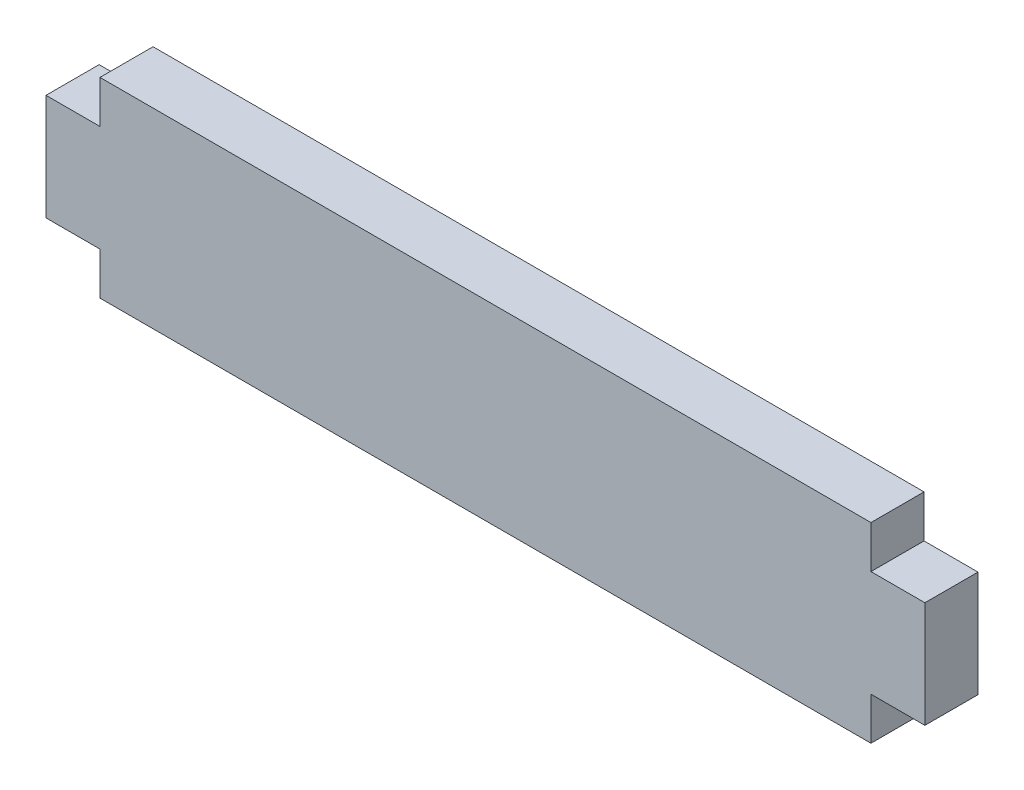
ISO-10303-21;
HEADER;
FILE_DESCRIPTION(('STEP AP214'),'2;1');
FILE_NAME('part.step','',(''),(''),'','','');
FILE_SCHEMA(('AUTOMOTIVE_DESIGN { 1 0 10303 214 1 1 1 1 }'));
ENDSEC;
DATA;
#1=APPLICATION_CONTEXT('core data for automotive mechanical design processes');
#2=APPLICATION_PROTOCOL_DEFINITION('international standard','automotive_design',2000,#1);
#3=PRODUCT_CONTEXT('',#1,'mechanical');
#4=PRODUCT('Part','Part','',(#3));
#5=PRODUCT_RELATED_PRODUCT_CATEGORY('part','',(#4));
#6=PRODUCT_DEFINITION_FORMATION('','',#4);
#7=PRODUCT_DEFINITION_CONTEXT('part definition',#1,'design');
#8=PRODUCT_DEFINITION('design','',#6,#7);
#9=PRODUCT_DEFINITION_SHAPE('','',#8);
#10=(LENGTH_UNIT() NAMED_UNIT(*) SI_UNIT(.MILLI.,.METRE.));
#11=(NAMED_UNIT(*) PLANE_ANGLE_UNIT() SI_UNIT($,.RADIAN.));
#12=(NAMED_UNIT(*) SI_UNIT($,.STERADIAN.) SOLID_ANGLE_UNIT());
#13=UNCERTAINTY_MEASURE_WITH_UNIT(LENGTH_MEASURE(1.E-05),#10,'distance_accuracy_value','');
#14=(GEOMETRIC_REPRESENTATION_CONTEXT(3) GLOBAL_UNCERTAINTY_ASSIGNED_CONTEXT((#13)) GLOBAL_UNIT_ASSIGNED_CONTEXT((#10,
#11,#12)) REPRESENTATION_CONTEXT('',''));
#15=CARTESIAN_POINT('',(0.,0.,0.));
#16=DIRECTION('',(0.,0.,1.));
#17=DIRECTION('',(1.,0.,0.));
#18=AXIS2_PLACEMENT_3D('',#15,#16,#17);
#19=CARTESIAN_POINT('',(23.0505,3.175,3.175));
#20=DIRECTION('',(-1.,0.,0.));
#21=DIRECTION('',(0.,0.,1.));
#22=AXIS2_PLACEMENT_3D('',#19,#20,#21);
#23=PLANE('',#22);
#24=DIRECTION('',(0.,1.,0.));
#25=VECTOR('',#24,1.);
#26=CARTESIAN_POINT('',(23.0505,3.175,0.));
#27=LINE('',#26,#25);
#28=CARTESIAN_POINT('',(23.0505,3.175,0.));
#29=VERTEX_POINT('',#28);
#30=CARTESIAN_POINT('',(23.0505,5.715,0.));
#31=VERTEX_POINT('',#30);
#32=EDGE_CURVE('E152',#29,#31,#27,.T.);
#33=ORIENTED_EDGE('',*,*,#32,.T.);
#34=DIRECTION('',(0.,0.,-1.));
#35=VECTOR('',#34,1.);
#36=CARTESIAN_POINT('',(23.0505,5.715,3.175));
#37=LINE('',#36,#35);
#38=CARTESIAN_POINT('',(23.0505,5.715,3.175));
#39=VERTEX_POINT('',#38);
#40=EDGE_CURVE('E11',#39,#31,#37,.T.);
#41=ORIENTED_EDGE('',*,*,#40,.F.);
#42=DIRECTION('',(0.,1.,0.));
#43=VECTOR('',#42,1.);
#44=CARTESIAN_POINT('',(23.0505,3.175,3.175));
#45=LINE('',#44,#43);
#46=CARTESIAN_POINT('',(23.0505,3.175,3.175));
#47=VERTEX_POINT('',#46);
#48=EDGE_CURVE('E174',#47,#39,#45,.T.);
#49=ORIENTED_EDGE('',*,*,#48,.F.);
#50=DIRECTION('',(0.,0.,-1.));
#51=VECTOR('',#50,1.);
#52=CARTESIAN_POINT('',(23.0505,3.175,3.175));
#53=LINE('',#52,#51);
#54=EDGE_CURVE('E148',#47,#29,#53,.T.);
#55=ORIENTED_EDGE('',*,*,#54,.T.);
#56=EDGE_LOOP('',(#33,#41,#49,#55));
#57=FACE_BOUND('',#56,.T.);
#58=ADVANCED_FACE('F32',(#57),#23,.F.);
#59=CARTESIAN_POINT('',(-23.0505,5.715,3.175));
#60=DIRECTION('',(0.,-1.,0.));
#61=DIRECTION('',(0.,0.,-1.));
#62=AXIS2_PLACEMENT_3D('',#59,#60,#61);
#63=PLANE('',#62);
#64=DIRECTION('',(-1.,0.,0.));
#65=VECTOR('',#64,1.);
#66=CARTESIAN_POINT('',(-23.0505,5.715,0.));
#67=LINE('',#66,#65);
#68=CARTESIAN_POINT('',(-23.0505,5.715,0.));
#69=VERTEX_POINT('',#68);
#70=EDGE_CURVE('E155',#31,#69,#67,.T.);
#71=ORIENTED_EDGE('',*,*,#70,.T.);
#72=DIRECTION('',(0.,0.,-1.));
#73=VECTOR('',#72,1.);
#74=CARTESIAN_POINT('',(-23.0505,5.715,3.175));
#75=LINE('',#74,#73);
#76=CARTESIAN_POINT('',(-23.0505,5.715,3.175));
#77=VERTEX_POINT('',#76);
#78=EDGE_CURVE('E40',#77,#69,#75,.T.);
#79=ORIENTED_EDGE('',*,*,#78,.F.);
#80=DIRECTION('',(-1.,0.,0.));
#81=VECTOR('',#80,1.);
#82=CARTESIAN_POINT('',(-23.0505,5.715,3.175));
#83=LINE('',#82,#81);
#84=EDGE_CURVE('E103',#39,#77,#83,.T.);
#85=ORIENTED_EDGE('',*,*,#84,.F.);
#86=ORIENTED_EDGE('',*,*,#40,.T.);
#87=EDGE_LOOP('',(#71,#79,#85,#86));
#88=FACE_BOUND('',#87,.T.);
#89=ADVANCED_FACE('F252',(#88),#63,.F.);
#90=CARTESIAN_POINT('',(-23.0505,3.175,3.175));
#91=DIRECTION('',(1.,0.,0.));
#92=DIRECTION('',(0.,0.,-1.));
#93=AXIS2_PLACEMENT_3D('',#90,#91,#92);
#94=PLANE('',#93);
#95=DIRECTION('',(0.,-1.,0.));
#96=VECTOR('',#95,1.);
#97=CARTESIAN_POINT('',(-23.0505,3.175,0.));
#98=LINE('',#97,#96);
#99=CARTESIAN_POINT('',(-23.0505,3.175,0.));
#100=VERTEX_POINT('',#99);
#101=EDGE_CURVE('E157',#69,#100,#98,.T.);
#102=ORIENTED_EDGE('',*,*,#101,.T.);
#103=DIRECTION('',(0.,0.,-1.));
#104=VECTOR('',#103,1.);
#105=CARTESIAN_POINT('',(-23.0505,3.175,3.175));
#106=LINE('',#105,#104);
#107=CARTESIAN_POINT('',(-23.0505,3.175,3.175));
#108=VERTEX_POINT('',#107);
#109=EDGE_CURVE('E193',#108,#100,#106,.T.);
#110=ORIENTED_EDGE('',*,*,#109,.F.);
#111=DIRECTION('',(0.,-1.,0.));
#112=VECTOR('',#111,1.);
#113=CARTESIAN_POINT('',(-23.0505,3.175,3.175));
#114=LINE('',#113,#112);
#115=EDGE_CURVE('E201',#77,#108,#114,.T.);
#116=ORIENTED_EDGE('',*,*,#115,.F.);
#117=ORIENTED_EDGE('',*,*,#78,.T.);
#118=EDGE_LOOP('',(#102,#110,#116,#117));
#119=FACE_BOUND('',#118,.T.);
#120=ADVANCED_FACE('F199',(#119),#94,.F.);
#121=CARTESIAN_POINT('',(-23.0505,3.175,3.175));
#122=DIRECTION('',(0.,-1.,0.));
#123=DIRECTION('',(1.,0.,0.));
#124=AXIS2_PLACEMENT_3D('',#121,#122,#123);
#125=PLANE('',#124);
#126=DIRECTION('',(-1.,0.,0.));
#127=VECTOR('',#126,1.);
#128=CARTESIAN_POINT('',(-23.0505,3.175,0.));
#129=LINE('',#128,#127);
#130=CARTESIAN_POINT('',(-26.2763,3.175,0.));
#131=VERTEX_POINT('',#130);
#132=EDGE_CURVE('E159',#100,#131,#129,.T.);
#133=ORIENTED_EDGE('',*,*,#132,.T.);
#134=DIRECTION('',(0.,0.,-1.));
#135=VECTOR('',#134,1.);
#136=CARTESIAN_POINT('',(-26.2763,3.175,3.175));
#137=LINE('',#136,#135);
#138=CARTESIAN_POINT('',(-26.2763,3.175,3.175));
#139=VERTEX_POINT('',#138);
#140=EDGE_CURVE('E190',#139,#131,#137,.T.);
#141=ORIENTED_EDGE('',*,*,#140,.F.);
#142=DIRECTION('',(-1.,0.,0.));
#143=VECTOR('',#142,1.);
#144=CARTESIAN_POINT('',(-23.0505,3.175,3.175));
#145=LINE('',#144,#143);
#146=EDGE_CURVE('E219',#108,#139,#145,.T.);
#147=ORIENTED_EDGE('',*,*,#146,.F.);
#148=ORIENTED_EDGE('',*,*,#109,.T.);
#149=EDGE_LOOP('',(#133,#141,#147,#148));
#150=FACE_BOUND('',#149,.T.);
#151=ADVANCED_FACE('F210',(#150),#125,.F.);
#152=CARTESIAN_POINT('',(-26.2763,3.175,3.175));
#153=DIRECTION('',(1.,0.,0.));
#154=DIRECTION('',(0.,0.,-1.));
#155=AXIS2_PLACEMENT_3D('',#152,#153,#154);
#156=PLANE('',#155);
#157=DIRECTION('',(0.,-1.,0.));
#158=VECTOR('',#157,1.);
#159=CARTESIAN_POINT('',(-26.2763,3.175,0.));
#160=LINE('',#159,#158);
#161=CARTESIAN_POINT('',(-26.2763,-3.175,0.));
#162=VERTEX_POINT('',#161);
#163=EDGE_CURVE('E161',#131,#162,#160,.T.);
#164=ORIENTED_EDGE('',*,*,#163,.T.);
#165=DIRECTION('',(0.,0.,-1.));
#166=VECTOR('',#165,1.);
#167=CARTESIAN_POINT('',(-26.2763,-3.175,3.175));
#168=LINE('',#167,#166);
#169=CARTESIAN_POINT('',(-26.2763,-3.175,3.175));
#170=VERTEX_POINT('',#169);
#171=EDGE_CURVE('E187',#170,#162,#168,.T.);
#172=ORIENTED_EDGE('',*,*,#171,.F.);
#173=DIRECTION('',(0.,-1.,0.));
#174=VECTOR('',#173,1.);
#175=CARTESIAN_POINT('',(-26.2763,3.175,3.175));
#176=LINE('',#175,#174);
#177=EDGE_CURVE('E216',#139,#170,#176,.T.);
#178=ORIENTED_EDGE('',*,*,#177,.F.);
#179=ORIENTED_EDGE('',*,*,#140,.T.);
#180=EDGE_LOOP('',(#164,#172,#178,#179));
#181=FACE_BOUND('',#180,.T.);
#182=ADVANCED_FACE('F214',(#181),#156,.F.);
#183=CARTESIAN_POINT('',(-26.2763,-3.175,3.175));
#184=DIRECTION('',(0.,1.,0.));
#185=DIRECTION('',(0.,0.,1.));
#186=AXIS2_PLACEMENT_3D('',#183,#184,#185);
#187=PLANE('',#186);
#188=DIRECTION('',(1.,0.,0.));
#189=VECTOR('',#188,1.);
#190=CARTESIAN_POINT('',(-26.2763,-3.175,0.));
#191=LINE('',#190,#189);
#192=CARTESIAN_POINT('',(-23.0505,-3.175,0.));
#193=VERTEX_POINT('',#192);
#194=EDGE_CURVE('E163',#162,#193,#191,.T.);
#195=ORIENTED_EDGE('',*,*,#194,.T.);
#196=DIRECTION('',(0.,0.,-1.));
#197=VECTOR('',#196,1.);
#198=CARTESIAN_POINT('',(-23.0505,-3.175,3.175));
#199=LINE('',#198,#197);
#200=CARTESIAN_POINT('',(-23.0505,-3.175,3.175));
#201=VERTEX_POINT('',#200);
#202=EDGE_CURVE('E184',#201,#193,#199,.T.);
#203=ORIENTED_EDGE('',*,*,#202,.F.);
#204=DIRECTION('',(1.,0.,0.));
#205=VECTOR('',#204,1.);
#206=CARTESIAN_POINT('',(-26.2763,-3.175,3.175));
#207=LINE('',#206,#205);
#208=EDGE_CURVE('E218',#170,#201,#207,.T.);
#209=ORIENTED_EDGE('',*,*,#208,.F.);
#210=ORIENTED_EDGE('',*,*,#171,.T.);
#211=EDGE_LOOP('',(#195,#203,#209,#210));
#212=FACE_BOUND('',#211,.T.);
#213=ADVANCED_FACE('F265',(#212),#187,.F.);
#214=CARTESIAN_POINT('',(-23.0505,-5.715,3.175));
#215=DIRECTION('',(1.,0.,0.));
#216=DIRECTION('',(0.,0.,-1.));
#217=AXIS2_PLACEMENT_3D('',#214,#215,#216);
#218=PLANE('',#217);
#219=DIRECTION('',(0.,-1.,0.));
#220=VECTOR('',#219,1.);
#221=CARTESIAN_POINT('',(-23.0505,-5.715,0.));
#222=LINE('',#221,#220);
#223=CARTESIAN_POINT('',(-23.0505,-5.715,0.));
#224=VERTEX_POINT('',#223);
#225=EDGE_CURVE('E165',#193,#224,#222,.T.);
#226=ORIENTED_EDGE('',*,*,#225,.T.);
#227=DIRECTION('',(0.,0.,-1.));
#228=VECTOR('',#227,1.);
#229=CARTESIAN_POINT('',(-23.0505,-5.715,3.175));
#230=LINE('',#229,#228);
#231=CARTESIAN_POINT('',(-23.0505,-5.715,3.175));
#232=VERTEX_POINT('',#231);
#233=EDGE_CURVE('E181',#232,#224,#230,.T.);
#234=ORIENTED_EDGE('',*,*,#233,.F.);
#235=DIRECTION('',(0.,-1.,0.));
#236=VECTOR('',#235,1.);
#237=CARTESIAN_POINT('',(-23.0505,-5.715,3.175));
#238=LINE('',#237,#236);
#239=EDGE_CURVE('E221',#201,#232,#238,.T.);
#240=ORIENTED_EDGE('',*,*,#239,.F.);
#241=ORIENTED_EDGE('',*,*,#202,.T.);
#242=EDGE_LOOP('',(#226,#234,#240,#241));
#243=FACE_BOUND('',#242,.T.);
#244=ADVANCED_FACE('F268',(#243),#218,.F.);
#245=CARTESIAN_POINT('',(-23.0505,-5.715,3.175));
#246=DIRECTION('',(0.,1.,0.));
#247=DIRECTION('',(0.,0.,1.));
#248=AXIS2_PLACEMENT_3D('',#245,#246,#247);
#249=PLANE('',#248);
#250=DIRECTION('',(1.,0.,0.));
#251=VECTOR('',#250,1.);
#252=CARTESIAN_POINT('',(-23.0505,-5.715,0.));
#253=LINE('',#252,#251);
#254=CARTESIAN_POINT('',(23.0505,-5.715,0.));
#255=VERTEX_POINT('',#254);
#256=EDGE_CURVE('E167',#224,#255,#253,.T.);
#257=ORIENTED_EDGE('',*,*,#256,.T.);
#258=DIRECTION('',(0.,0.,-1.));
#259=VECTOR('',#258,1.);
#260=CARTESIAN_POINT('',(23.0505,-5.715,3.175));
#261=LINE('',#260,#259);
#262=CARTESIAN_POINT('',(23.0505,-5.715,3.175));
#263=VERTEX_POINT('',#262);
#264=EDGE_CURVE('E178',#263,#255,#261,.T.);
#265=ORIENTED_EDGE('',*,*,#264,.F.);
#266=DIRECTION('',(1.,0.,0.));
#267=VECTOR('',#266,1.);
#268=CARTESIAN_POINT('',(-23.0505,-5.715,3.175));
#269=LINE('',#268,#267);
#270=EDGE_CURVE('E227',#232,#263,#269,.T.);
#271=ORIENTED_EDGE('',*,*,#270,.F.);
#272=ORIENTED_EDGE('',*,*,#233,.T.);
#273=EDGE_LOOP('',(#257,#265,#271,#272));
#274=FACE_BOUND('',#273,.T.);
#275=ADVANCED_FACE('F233',(#274),#249,.F.);
#276=CARTESIAN_POINT('',(23.0505,-5.715,3.175));
#277=DIRECTION('',(-1.,0.,0.));
#278=DIRECTION('',(0.,0.,1.));
#279=AXIS2_PLACEMENT_3D('',#276,#277,#278);
#280=PLANE('',#279);
#281=DIRECTION('',(0.,1.,0.));
#282=VECTOR('',#281,1.);
#283=CARTESIAN_POINT('',(23.0505,-5.715,0.));
#284=LINE('',#283,#282);
#285=CARTESIAN_POINT('',(23.0505,-3.17500000000001,0.));
#286=VERTEX_POINT('',#285);
#287=EDGE_CURVE('E169',#255,#286,#284,.T.);
#288=ORIENTED_EDGE('',*,*,#287,.T.);
#289=DIRECTION('',(0.,0.,-1.));
#290=VECTOR('',#289,1.);
#291=CARTESIAN_POINT('',(23.0505,-3.17500000000001,3.175));
#292=LINE('',#291,#290);
#293=CARTESIAN_POINT('',(23.0505,-3.17500000000001,3.175));
#294=VERTEX_POINT('',#293);
#295=EDGE_CURVE('E143',#294,#286,#292,.T.);
#296=ORIENTED_EDGE('',*,*,#295,.F.);
#297=DIRECTION('',(0.,1.,0.));
#298=VECTOR('',#297,1.);
#299=CARTESIAN_POINT('',(23.0505,-5.715,3.175));
#300=LINE('',#299,#298);
#301=EDGE_CURVE('E134',#263,#294,#300,.T.);
#302=ORIENTED_EDGE('',*,*,#301,.F.);
#303=ORIENTED_EDGE('',*,*,#264,.T.);
#304=EDGE_LOOP('',(#288,#296,#302,#303));
#305=FACE_BOUND('',#304,.T.);
#306=ADVANCED_FACE('F237',(#305),#280,.F.);
#307=CARTESIAN_POINT('',(26.2763,-3.17500000000001,3.175));
#308=DIRECTION('',(0.,1.,0.));
#309=DIRECTION('',(-1.,0.,0.));
#310=AXIS2_PLACEMENT_3D('',#307,#308,#309);
#311=PLANE('',#310);
#312=DIRECTION('',(1.,0.,0.));
#313=VECTOR('',#312,1.);
#314=CARTESIAN_POINT('',(26.2763,-3.17500000000001,0.));
#315=LINE('',#314,#313);
#316=CARTESIAN_POINT('',(26.2763,-3.17500000000001,0.));
#317=VERTEX_POINT('',#316);
#318=EDGE_CURVE('E142',#286,#317,#315,.T.);
#319=ORIENTED_EDGE('',*,*,#318,.T.);
#320=DIRECTION('',(0.,0.,-1.));
#321=VECTOR('',#320,1.);
#322=CARTESIAN_POINT('',(26.2763,-3.17500000000001,3.175));
#323=LINE('',#322,#321);
#324=CARTESIAN_POINT('',(26.2763,-3.17500000000001,3.175));
#325=VERTEX_POINT('',#324);
#326=EDGE_CURVE('E139',#325,#317,#323,.T.);
#327=ORIENTED_EDGE('',*,*,#326,.F.);
#328=DIRECTION('',(1.,0.,0.));
#329=VECTOR('',#328,1.);
#330=CARTESIAN_POINT('',(26.2763,-3.17500000000001,3.175));
#331=LINE('',#330,#329);
#332=EDGE_CURVE('E128',#294,#325,#331,.T.);
#333=ORIENTED_EDGE('',*,*,#332,.F.);
#334=ORIENTED_EDGE('',*,*,#295,.T.);
#335=EDGE_LOOP('',(#319,#327,#333,#334));
#336=FACE_BOUND('',#335,.T.);
#337=ADVANCED_FACE('F140',(#336),#311,.F.);
#338=CARTESIAN_POINT('',(26.2763,3.175,3.175));
#339=DIRECTION('',(-1.,0.,0.));
#340=DIRECTION('',(0.,0.,1.));
#341=AXIS2_PLACEMENT_3D('',#338,#339,#340);
#342=PLANE('',#341);
#343=DIRECTION('',(0.,1.,0.));
#344=VECTOR('',#343,1.);
#345=CARTESIAN_POINT('',(26.2763,3.175,0.));
#346=LINE('',#345,#344);
#347=CARTESIAN_POINT('',(26.2763,3.175,0.));
#348=VERTEX_POINT('',#347);
#349=EDGE_CURVE('E89',#317,#348,#346,.T.);
#350=ORIENTED_EDGE('',*,*,#349,.T.);
#351=DIRECTION('',(0.,0.,-1.));
#352=VECTOR('',#351,1.);
#353=CARTESIAN_POINT('',(26.2763,3.175,3.175));
#354=LINE('',#353,#352);
#355=CARTESIAN_POINT('',(26.2763,3.175,3.175));
#356=VERTEX_POINT('',#355);
#357=EDGE_CURVE('E144',#356,#348,#354,.T.);
#358=ORIENTED_EDGE('',*,*,#357,.F.);
#359=DIRECTION('',(0.,1.,0.));
#360=VECTOR('',#359,1.);
#361=CARTESIAN_POINT('',(26.2763,3.175,3.175));
#362=LINE('',#361,#360);
#363=EDGE_CURVE('E132',#325,#356,#362,.T.);
#364=ORIENTED_EDGE('',*,*,#363,.F.);
#365=ORIENTED_EDGE('',*,*,#326,.T.);
#366=EDGE_LOOP('',(#350,#358,#364,#365));
#367=FACE_BOUND('',#366,.T.);
#368=ADVANCED_FACE('F146',(#367),#342,.F.);
#369=CARTESIAN_POINT('',(23.0505,3.175,3.175));
#370=DIRECTION('',(0.,-1.,0.));
#371=DIRECTION('',(0.,0.,-1.));
#372=AXIS2_PLACEMENT_3D('',#369,#370,#371);
#373=PLANE('',#372);
#374=DIRECTION('',(-1.,0.,0.));
#375=VECTOR('',#374,1.);
#376=CARTESIAN_POINT('',(23.0505,3.175,0.));
#377=LINE('',#376,#375);
#378=EDGE_CURVE('E95',#348,#29,#377,.T.);
#379=ORIENTED_EDGE('',*,*,#378,.T.);
#380=ORIENTED_EDGE('',*,*,#54,.F.);
#381=DIRECTION('',(-1.,0.,0.));
#382=VECTOR('',#381,1.);
#383=CARTESIAN_POINT('',(23.0505,3.175,3.175));
#384=LINE('',#383,#382);
#385=EDGE_CURVE('E48',#356,#47,#384,.T.);
#386=ORIENTED_EDGE('',*,*,#385,.F.);
#387=ORIENTED_EDGE('',*,*,#357,.T.);
#388=EDGE_LOOP('',(#379,#380,#386,#387));
#389=FACE_BOUND('',#388,.T.);
#390=ADVANCED_FACE('F241',(#389),#373,.F.);
#391=CARTESIAN_POINT('',(23.0505,5.715,3.175));
#392=DIRECTION('',(0.,0.,-1.));
#393=DIRECTION('',(-1.,0.,0.));
#394=AXIS2_PLACEMENT_3D('',#391,#392,#393);
#395=PLANE('',#394);
#396=ORIENTED_EDGE('',*,*,#48,.T.);
#397=ORIENTED_EDGE('',*,*,#84,.T.);
#398=ORIENTED_EDGE('',*,*,#115,.T.);
#399=ORIENTED_EDGE('',*,*,#146,.T.);
#400=ORIENTED_EDGE('',*,*,#177,.T.);
#401=ORIENTED_EDGE('',*,*,#208,.T.);
#402=ORIENTED_EDGE('',*,*,#239,.T.);
#403=ORIENTED_EDGE('',*,*,#270,.T.);
#404=ORIENTED_EDGE('',*,*,#301,.T.);
#405=ORIENTED_EDGE('',*,*,#332,.T.);
#406=ORIENTED_EDGE('',*,*,#363,.T.);
#407=ORIENTED_EDGE('',*,*,#385,.T.);
#408=EDGE_LOOP('',(#396,#397,#398,#399,#400,#401,#402,#403,#404,#405,#406,#407));
#409=FACE_BOUND('',#408,.T.);
#410=ADVANCED_FACE('F130',(#409),#395,.F.);
#411=CARTESIAN_POINT('',(23.0505,5.715,0.));
#412=DIRECTION('',(0.,0.,-1.));
#413=DIRECTION('',(-1.,0.,0.));
#414=AXIS2_PLACEMENT_3D('',#411,#412,#413);
#415=PLANE('',#414);
#416=ORIENTED_EDGE('',*,*,#32,.F.);
#417=ORIENTED_EDGE('',*,*,#378,.F.);
#418=ORIENTED_EDGE('',*,*,#349,.F.);
#419=ORIENTED_EDGE('',*,*,#318,.F.);
#420=ORIENTED_EDGE('',*,*,#287,.F.);
#421=ORIENTED_EDGE('',*,*,#256,.F.);
#422=ORIENTED_EDGE('',*,*,#225,.F.);
#423=ORIENTED_EDGE('',*,*,#194,.F.);
#424=ORIENTED_EDGE('',*,*,#163,.F.);
#425=ORIENTED_EDGE('',*,*,#132,.F.);
#426=ORIENTED_EDGE('',*,*,#101,.F.);
#427=ORIENTED_EDGE('',*,*,#70,.F.);
#428=EDGE_LOOP('',(#416,#417,#418,#419,#420,#421,#422,#423,#424,#425,#426,#427));
#429=FACE_BOUND('',#428,.T.);
#430=ADVANCED_FACE('F205',(#429),#415,.T.);
#431=CLOSED_SHELL('',(#58,#89,#120,#151,#182,#213,#244,#275,#306,#337,#368,#390,#410,#430));
#432=MANIFOLD_SOLID_BREP('B2',#431);
#433=ADVANCED_BREP_SHAPE_REPRESENTATION('',(#18,#432),#14);
#434=SHAPE_DEFINITION_REPRESENTATION(#9,#433);
ENDSEC;
END-ISO-10303-21;
